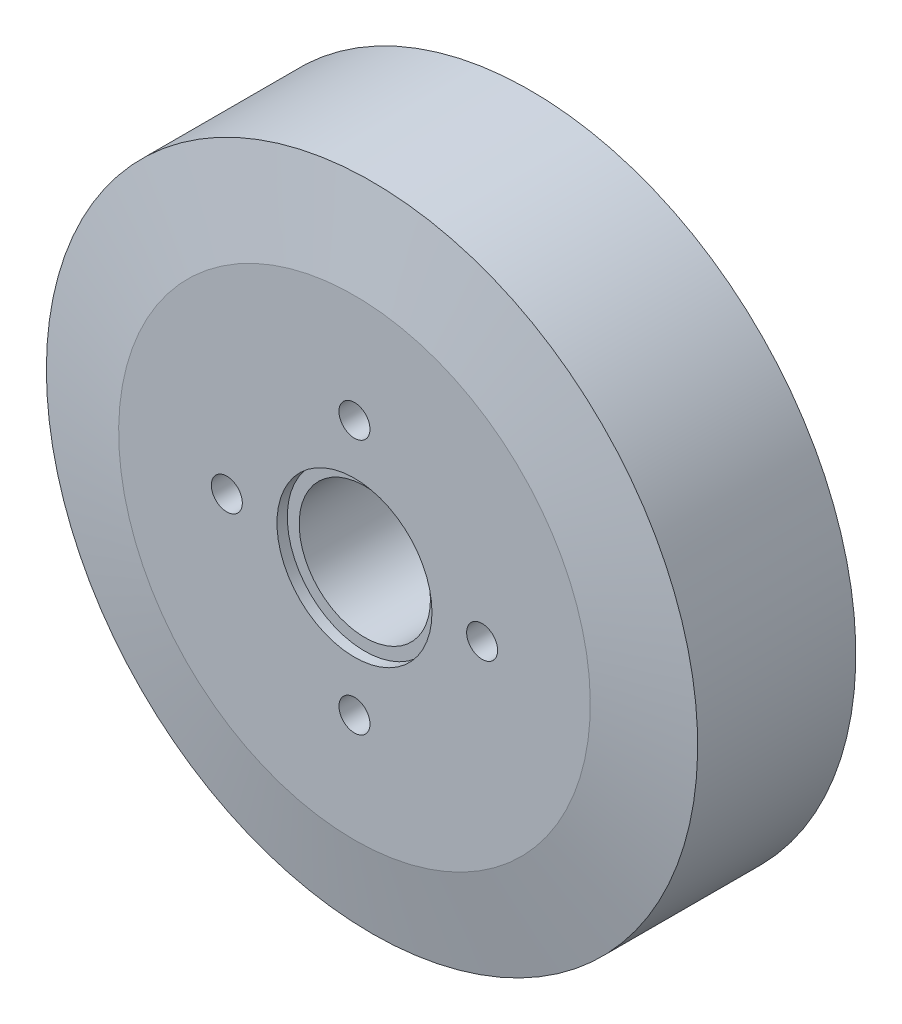
ISO-10303-21;
HEADER;
FILE_DESCRIPTION(('STEP AP214'),'2;1');
FILE_NAME('part.step','',(''),(''),'','','');
FILE_SCHEMA(('AUTOMOTIVE_DESIGN { 1 0 10303 214 1 1 1 1 }'));
ENDSEC;
DATA;
#1=APPLICATION_CONTEXT('core data for automotive mechanical design processes');
#2=APPLICATION_PROTOCOL_DEFINITION('international standard','automotive_design',2000,#1);
#3=PRODUCT_CONTEXT('',#1,'mechanical');
#4=PRODUCT('Part','Part','',(#3));
#5=PRODUCT_RELATED_PRODUCT_CATEGORY('part','',(#4));
#6=PRODUCT_DEFINITION_FORMATION('','',#4);
#7=PRODUCT_DEFINITION_CONTEXT('part definition',#1,'design');
#8=PRODUCT_DEFINITION('design','',#6,#7);
#9=PRODUCT_DEFINITION_SHAPE('','',#8);
#10=(LENGTH_UNIT() NAMED_UNIT(*) SI_UNIT(.MILLI.,.METRE.));
#11=(NAMED_UNIT(*) PLANE_ANGLE_UNIT() SI_UNIT($,.RADIAN.));
#12=(NAMED_UNIT(*) SI_UNIT($,.STERADIAN.) SOLID_ANGLE_UNIT());
#13=UNCERTAINTY_MEASURE_WITH_UNIT(LENGTH_MEASURE(1.E-05),#10,'distance_accuracy_value','');
#14=(GEOMETRIC_REPRESENTATION_CONTEXT(3) GLOBAL_UNCERTAINTY_ASSIGNED_CONTEXT((#13)) GLOBAL_UNIT_ASSIGNED_CONTEXT((#10,
#11,#12)) REPRESENTATION_CONTEXT('',''));
#15=CARTESIAN_POINT('',(0.,0.,0.));
#16=DIRECTION('',(0.,0.,1.));
#17=DIRECTION('',(1.,0.,0.));
#18=AXIS2_PLACEMENT_3D('',#15,#16,#17);
#19=CARTESIAN_POINT('',(0.,0.,0.));
#20=DIRECTION('',(0.,0.,1.));
#21=DIRECTION('',(1.,0.,0.));
#22=AXIS2_PLACEMENT_3D('',#19,#20,#21);
#23=PLANE('',#22);
#24=CARTESIAN_POINT('',(0.,0.,0.));
#25=DIRECTION('',(0.,0.,1.));
#26=DIRECTION('',(-1.,0.,0.));
#27=AXIS2_PLACEMENT_3D('',#24,#25,#26);
#28=CIRCLE('',#27,6.35);
#29=CARTESIAN_POINT('',(6.35,0.,0.));
#30=VERTEX_POINT('',#29);
#31=EDGE_CURVE('E103',#30,#30,#28,.T.);
#32=ORIENTED_EDGE('',*,*,#31,.T.);
#33=EDGE_LOOP('',(#32));
#34=FACE_BOUND('',#33,.T.);
#35=CARTESIAN_POINT('',(-12.35,0.,0.));
#36=DIRECTION('',(0.,0.,1.));
#37=DIRECTION('',(-1.,0.,0.));
#38=AXIS2_PLACEMENT_3D('',#35,#36,#37);
#39=CIRCLE('',#38,1.5);
#40=CARTESIAN_POINT('',(-10.85,0.,0.));
#41=VERTEX_POINT('',#40);
#42=EDGE_CURVE('E172',#41,#41,#39,.T.);
#43=ORIENTED_EDGE('',*,*,#42,.T.);
#44=EDGE_LOOP('',(#43));
#45=FACE_BOUND('',#44,.T.);
#46=CARTESIAN_POINT('',(0.,-12.35,0.));
#47=DIRECTION('',(0.,0.,1.));
#48=DIRECTION('',(-1.,0.,0.));
#49=AXIS2_PLACEMENT_3D('',#46,#47,#48);
#50=CIRCLE('',#49,1.5);
#51=CARTESIAN_POINT('',(1.5,-12.35,0.));
#52=VERTEX_POINT('',#51);
#53=EDGE_CURVE('E143',#52,#52,#50,.T.);
#54=ORIENTED_EDGE('',*,*,#53,.T.);
#55=EDGE_LOOP('',(#54));
#56=FACE_BOUND('',#55,.T.);
#57=CARTESIAN_POINT('',(0.,12.35,0.));
#58=DIRECTION('',(0.,0.,1.));
#59=DIRECTION('',(-1.,0.,0.));
#60=AXIS2_PLACEMENT_3D('',#57,#58,#59);
#61=CIRCLE('',#60,1.5);
#62=CARTESIAN_POINT('',(1.5,12.35,0.));
#63=VERTEX_POINT('',#62);
#64=EDGE_CURVE('E189',#63,#63,#61,.T.);
#65=ORIENTED_EDGE('',*,*,#64,.T.);
#66=EDGE_LOOP('',(#65));
#67=FACE_BOUND('',#66,.T.);
#68=CARTESIAN_POINT('',(12.35,0.,0.));
#69=DIRECTION('',(0.,0.,1.));
#70=DIRECTION('',(-1.,0.,0.));
#71=AXIS2_PLACEMENT_3D('',#68,#69,#70);
#72=CIRCLE('',#71,1.5);
#73=CARTESIAN_POINT('',(13.85,0.,0.));
#74=VERTEX_POINT('',#73);
#75=EDGE_CURVE('E61',#74,#74,#72,.T.);
#76=ORIENTED_EDGE('',*,*,#75,.T.);
#77=EDGE_LOOP('',(#76));
#78=FACE_BOUND('',#77,.T.);
#79=CARTESIAN_POINT('',(0.,0.,0.));
#80=DIRECTION('',(0.,0.,1.));
#81=DIRECTION('',(1.,0.,0.));
#82=AXIS2_PLACEMENT_3D('',#79,#80,#81);
#83=CIRCLE('',#82,31.51);
#84=CARTESIAN_POINT('',(-31.51,0.,0.));
#85=VERTEX_POINT('',#84);
#86=EDGE_CURVE('E10',#85,#85,#83,.T.);
#87=ORIENTED_EDGE('',*,*,#86,.F.);
#88=EDGE_LOOP('',(#87));
#89=FACE_BOUND('',#88,.T.);
#90=ADVANCED_FACE('F15',(#34,#45,#56,#67,#78,#89),#23,.F.);
#91=CARTESIAN_POINT('',(0.,0.,17.));
#92=DIRECTION('',(0.,0.,1.));
#93=DIRECTION('',(1.,0.,0.));
#94=AXIS2_PLACEMENT_3D('',#91,#92,#93);
#95=PLANE('',#94);
#96=CARTESIAN_POINT('',(0.,0.,17.));
#97=DIRECTION('',(0.,0.,-1.));
#98=DIRECTION('',(-1.,0.,0.));
#99=AXIS2_PLACEMENT_3D('',#96,#97,#98);
#100=CIRCLE('',#99,7.5);
#101=CARTESIAN_POINT('',(7.5,0.,17.));
#102=VERTEX_POINT('',#101);
#103=EDGE_CURVE('E167',#102,#102,#100,.T.);
#104=ORIENTED_EDGE('',*,*,#103,.T.);
#105=EDGE_LOOP('',(#104));
#106=FACE_BOUND('',#105,.T.);
#107=CARTESIAN_POINT('',(-12.35,0.,17.));
#108=DIRECTION('',(0.,0.,-1.));
#109=DIRECTION('',(-1.,0.,0.));
#110=AXIS2_PLACEMENT_3D('',#107,#108,#109);
#111=CIRCLE('',#110,1.5);
#112=CARTESIAN_POINT('',(-10.85,0.,17.));
#113=VERTEX_POINT('',#112);
#114=EDGE_CURVE('E146',#113,#113,#111,.T.);
#115=ORIENTED_EDGE('',*,*,#114,.T.);
#116=EDGE_LOOP('',(#115));
#117=FACE_BOUND('',#116,.T.);
#118=CARTESIAN_POINT('',(0.,-12.35,17.));
#119=DIRECTION('',(0.,0.,-1.));
#120=DIRECTION('',(-1.,0.,0.));
#121=AXIS2_PLACEMENT_3D('',#118,#119,#120);
#122=CIRCLE('',#121,1.5);
#123=CARTESIAN_POINT('',(1.5,-12.35,17.));
#124=VERTEX_POINT('',#123);
#125=EDGE_CURVE('E190',#124,#124,#122,.T.);
#126=ORIENTED_EDGE('',*,*,#125,.T.);
#127=EDGE_LOOP('',(#126));
#128=FACE_BOUND('',#127,.T.);
#129=CARTESIAN_POINT('',(0.,12.35,17.));
#130=DIRECTION('',(0.,0.,-1.));
#131=DIRECTION('',(-1.,0.,0.));
#132=AXIS2_PLACEMENT_3D('',#129,#130,#131);
#133=CIRCLE('',#132,1.5);
#134=CARTESIAN_POINT('',(1.5,12.35,17.));
#135=VERTEX_POINT('',#134);
#136=EDGE_CURVE('E131',#135,#135,#133,.T.);
#137=ORIENTED_EDGE('',*,*,#136,.T.);
#138=EDGE_LOOP('',(#137));
#139=FACE_BOUND('',#138,.T.);
#140=CARTESIAN_POINT('',(12.35,0.,17.));
#141=DIRECTION('',(0.,0.,-1.));
#142=DIRECTION('',(-1.,0.,0.));
#143=AXIS2_PLACEMENT_3D('',#140,#141,#142);
#144=CIRCLE('',#143,1.5);
#145=CARTESIAN_POINT('',(13.85,0.,17.));
#146=VERTEX_POINT('',#145);
#147=EDGE_CURVE('E122',#146,#146,#144,.T.);
#148=ORIENTED_EDGE('',*,*,#147,.T.);
#149=EDGE_LOOP('',(#148));
#150=FACE_BOUND('',#149,.T.);
#151=CARTESIAN_POINT('',(0.,0.,17.));
#152=DIRECTION('',(0.,0.,1.));
#153=DIRECTION('',(0.,1.,0.));
#154=AXIS2_PLACEMENT_3D('',#151,#152,#153);
#155=CIRCLE('',#154,22.8188415802262);
#156=CARTESIAN_POINT('',(0.,-22.8188415802262,17.));
#157=VERTEX_POINT('',#156);
#158=EDGE_CURVE('E108',#157,#157,#155,.T.);
#159=ORIENTED_EDGE('',*,*,#158,.T.);
#160=EDGE_LOOP('',(#159));
#161=FACE_BOUND('',#160,.T.);
#162=ADVANCED_FACE('F208',(#106,#117,#128,#139,#150,#161),#95,.T.);
#163=CARTESIAN_POINT('',(0.,0.,0.));
#164=DIRECTION('',(0.,0.,1.));
#165=DIRECTION('',(1.,0.,0.));
#166=AXIS2_PLACEMENT_3D('',#163,#164,#165);
#167=CYLINDRICAL_SURFACE('',#166,31.51);
#168=CARTESIAN_POINT('',(0.,0.,15.3017276651017));
#169=DIRECTION('',(0.,0.,-1.));
#170=DIRECTION('',(1.,0.,0.));
#171=AXIS2_PLACEMENT_3D('',#168,#169,#170);
#172=CIRCLE('',#171,31.51);
#173=CARTESIAN_POINT('',(-31.51,0.,15.3017276651017));
#174=VERTEX_POINT('',#173);
#175=CARTESIAN_POINT('',(0.,-31.51,15.3017276651017));
#176=VERTEX_POINT('',#175);
#177=EDGE_CURVE('E153',#174,#176,#172,.T.);
#178=ORIENTED_EDGE('',*,*,#177,.T.);
#179=CARTESIAN_POINT('',(0.,0.,15.3017276651017));
#180=DIRECTION('',(0.,0.,-1.));
#181=DIRECTION('',(1.,0.,0.));
#182=AXIS2_PLACEMENT_3D('',#179,#180,#181);
#183=CIRCLE('',#182,31.51);
#184=EDGE_CURVE('E141',#176,#174,#183,.T.);
#185=ORIENTED_EDGE('',*,*,#184,.T.);
#186=DIRECTION('',(0.,0.,-1.));
#187=VECTOR('',#186,1.);
#188=CARTESIAN_POINT('',(-31.51,0.,0.));
#189=LINE('',#188,#187);
#190=EDGE_CURVE('E26',#174,#85,#189,.T.);
#191=ORIENTED_EDGE('',*,*,#190,.T.);
#192=ORIENTED_EDGE('',*,*,#86,.T.);
#193=ORIENTED_EDGE('',*,*,#190,.F.);
#194=EDGE_LOOP('',(#178,#185,#191,#192,#193));
#195=FACE_BOUND('',#194,.T.);
#196=ADVANCED_FACE('F211',(#195),#167,.T.);
#197=CARTESIAN_POINT('',(0.,0.,16.1499996200204));
#198=DIRECTION('',(0.,0.,-1.));
#199=DIRECTION('',(0.,1.,0.));
#200=AXIS2_PLACEMENT_3D('',#197,#198,#199);
#201=CONICAL_SURFACE('',#200,27.1688435248278,1.37782551682933);
#202=ORIENTED_EDGE('',*,*,#158,.F.);
#203=DIRECTION('',(0.,-0.981438838615264,-0.191775405246661));
#204=VECTOR('',#203,1.);
#205=CARTESIAN_POINT('',(0.,-27.1688435248278,16.1499996200204));
#206=LINE('',#205,#204);
#207=EDGE_CURVE('E117',#157,#176,#206,.T.);
#208=ORIENTED_EDGE('',*,*,#207,.T.);
#209=ORIENTED_EDGE('',*,*,#177,.F.);
#210=ORIENTED_EDGE('',*,*,#184,.F.);
#211=ORIENTED_EDGE('',*,*,#207,.F.);
#212=EDGE_LOOP('',(#202,#208,#209,#210,#211));
#213=FACE_BOUND('',#212,.T.);
#214=ADVANCED_FACE('F220',(#213),#201,.T.);
#215=CARTESIAN_POINT('',(0.,0.,17.));
#216=DIRECTION('',(0.,0.,-1.));
#217=DIRECTION('',(-1.,0.,0.));
#218=AXIS2_PLACEMENT_3D('',#215,#216,#217);
#219=CYLINDRICAL_SURFACE('',#218,6.35);
#220=CARTESIAN_POINT('',(0.,0.,16.));
#221=DIRECTION('',(0.,0.,1.));
#222=DIRECTION('',(-1.,0.,0.));
#223=AXIS2_PLACEMENT_3D('',#220,#221,#222);
#224=CIRCLE('',#223,6.35);
#225=CARTESIAN_POINT('',(6.35,0.,16.));
#226=VERTEX_POINT('',#225);
#227=EDGE_CURVE('E119',#226,#226,#224,.T.);
#228=ORIENTED_EDGE('',*,*,#227,.T.);
#229=DIRECTION('',(0.,0.,-1.));
#230=VECTOR('',#229,1.);
#231=CARTESIAN_POINT('',(6.35,0.,17.));
#232=LINE('',#231,#230);
#233=EDGE_CURVE('E109',#226,#30,#232,.T.);
#234=ORIENTED_EDGE('',*,*,#233,.T.);
#235=ORIENTED_EDGE('',*,*,#31,.F.);
#236=ORIENTED_EDGE('',*,*,#233,.F.);
#237=EDGE_LOOP('',(#228,#234,#235,#236));
#238=FACE_BOUND('',#237,.T.);
#239=ADVANCED_FACE('F263',(#238),#219,.F.);
#240=CARTESIAN_POINT('',(0.,0.,16.));
#241=DIRECTION('',(0.,0.,1.));
#242=DIRECTION('',(1.,0.,0.));
#243=AXIS2_PLACEMENT_3D('',#240,#241,#242);
#244=PLANE('',#243);
#245=ORIENTED_EDGE('',*,*,#227,.F.);
#246=EDGE_LOOP('',(#245));
#247=FACE_BOUND('',#246,.T.);
#248=CARTESIAN_POINT('',(0.,0.,16.));
#249=DIRECTION('',(0.,0.,-1.));
#250=DIRECTION('',(-1.,0.,0.));
#251=AXIS2_PLACEMENT_3D('',#248,#249,#250);
#252=CIRCLE('',#251,7.5);
#253=CARTESIAN_POINT('',(7.5,0.,16.));
#254=VERTEX_POINT('',#253);
#255=EDGE_CURVE('E175',#254,#254,#252,.T.);
#256=ORIENTED_EDGE('',*,*,#255,.F.);
#257=EDGE_LOOP('',(#256));
#258=FACE_BOUND('',#257,.T.);
#259=ADVANCED_FACE('F270',(#247,#258),#244,.T.);
#260=CARTESIAN_POINT('',(0.,0.,17.));
#261=DIRECTION('',(0.,0.,-1.));
#262=DIRECTION('',(-1.,0.,0.));
#263=AXIS2_PLACEMENT_3D('',#260,#261,#262);
#264=CYLINDRICAL_SURFACE('',#263,7.5);
#265=ORIENTED_EDGE('',*,*,#103,.F.);
#266=DIRECTION('',(0.,0.,-1.));
#267=VECTOR('',#266,1.);
#268=CARTESIAN_POINT('',(7.5,0.,17.));
#269=LINE('',#268,#267);
#270=EDGE_CURVE('E171',#102,#254,#269,.T.);
#271=ORIENTED_EDGE('',*,*,#270,.T.);
#272=ORIENTED_EDGE('',*,*,#255,.T.);
#273=ORIENTED_EDGE('',*,*,#270,.F.);
#274=EDGE_LOOP('',(#265,#271,#272,#273));
#275=FACE_BOUND('',#274,.T.);
#276=ADVANCED_FACE('F278',(#275),#264,.F.);
#277=CARTESIAN_POINT('',(-12.35,0.,17.));
#278=DIRECTION('',(0.,0.,-1.));
#279=DIRECTION('',(-1.,0.,0.));
#280=AXIS2_PLACEMENT_3D('',#277,#278,#279);
#281=CYLINDRICAL_SURFACE('',#280,1.5);
#282=ORIENTED_EDGE('',*,*,#114,.F.);
#283=DIRECTION('',(0.,0.,-1.));
#284=VECTOR('',#283,1.);
#285=CARTESIAN_POINT('',(-10.85,0.,17.));
#286=LINE('',#285,#284);
#287=EDGE_CURVE('E180',#113,#41,#286,.T.);
#288=ORIENTED_EDGE('',*,*,#287,.T.);
#289=ORIENTED_EDGE('',*,*,#42,.F.);
#290=ORIENTED_EDGE('',*,*,#287,.F.);
#291=EDGE_LOOP('',(#282,#288,#289,#290));
#292=FACE_BOUND('',#291,.T.);
#293=ADVANCED_FACE('F206',(#292),#281,.F.);
#294=CARTESIAN_POINT('',(0.,-12.35,17.));
#295=DIRECTION('',(0.,0.,-1.));
#296=DIRECTION('',(-1.,0.,0.));
#297=AXIS2_PLACEMENT_3D('',#294,#295,#296);
#298=CYLINDRICAL_SURFACE('',#297,1.5);
#299=ORIENTED_EDGE('',*,*,#125,.F.);
#300=DIRECTION('',(0.,0.,-1.));
#301=VECTOR('',#300,1.);
#302=CARTESIAN_POINT('',(1.5,-12.35,17.));
#303=LINE('',#302,#301);
#304=EDGE_CURVE('E147',#124,#52,#303,.T.);
#305=ORIENTED_EDGE('',*,*,#304,.T.);
#306=ORIENTED_EDGE('',*,*,#53,.F.);
#307=ORIENTED_EDGE('',*,*,#304,.F.);
#308=EDGE_LOOP('',(#299,#305,#306,#307));
#309=FACE_BOUND('',#308,.T.);
#310=ADVANCED_FACE('F285',(#309),#298,.F.);
#311=CARTESIAN_POINT('',(0.,12.35,17.));
#312=DIRECTION('',(0.,0.,-1.));
#313=DIRECTION('',(-1.,0.,0.));
#314=AXIS2_PLACEMENT_3D('',#311,#312,#313);
#315=CYLINDRICAL_SURFACE('',#314,1.5);
#316=ORIENTED_EDGE('',*,*,#136,.F.);
#317=DIRECTION('',(0.,0.,-1.));
#318=VECTOR('',#317,1.);
#319=CARTESIAN_POINT('',(1.5,12.35,17.));
#320=LINE('',#319,#318);
#321=EDGE_CURVE('E137',#135,#63,#320,.T.);
#322=ORIENTED_EDGE('',*,*,#321,.T.);
#323=ORIENTED_EDGE('',*,*,#64,.F.);
#324=ORIENTED_EDGE('',*,*,#321,.F.);
#325=EDGE_LOOP('',(#316,#322,#323,#324));
#326=FACE_BOUND('',#325,.T.);
#327=ADVANCED_FACE('F282',(#326),#315,.F.);
#328=CARTESIAN_POINT('',(12.35,0.,17.));
#329=DIRECTION('',(0.,0.,-1.));
#330=DIRECTION('',(-1.,0.,0.));
#331=AXIS2_PLACEMENT_3D('',#328,#329,#330);
#332=CYLINDRICAL_SURFACE('',#331,1.5);
#333=ORIENTED_EDGE('',*,*,#147,.F.);
#334=DIRECTION('',(0.,0.,-1.));
#335=VECTOR('',#334,1.);
#336=CARTESIAN_POINT('',(13.85,0.,17.));
#337=LINE('',#336,#335);
#338=EDGE_CURVE('E19',#146,#74,#337,.T.);
#339=ORIENTED_EDGE('',*,*,#338,.T.);
#340=ORIENTED_EDGE('',*,*,#75,.F.);
#341=ORIENTED_EDGE('',*,*,#338,.F.);
#342=EDGE_LOOP('',(#333,#339,#340,#341));
#343=FACE_BOUND('',#342,.T.);
#344=ADVANCED_FACE('F17',(#343),#332,.F.);
#345=CLOSED_SHELL('',(#90,#162,#196,#214,#239,#259,#276,#293,#310,#327,#344));
#346=MANIFOLD_SOLID_BREP('B1',#345);
#347=ADVANCED_BREP_SHAPE_REPRESENTATION('',(#18,#346),#14);
#348=SHAPE_DEFINITION_REPRESENTATION(#9,#347);
ENDSEC;
END-ISO-10303-21;
